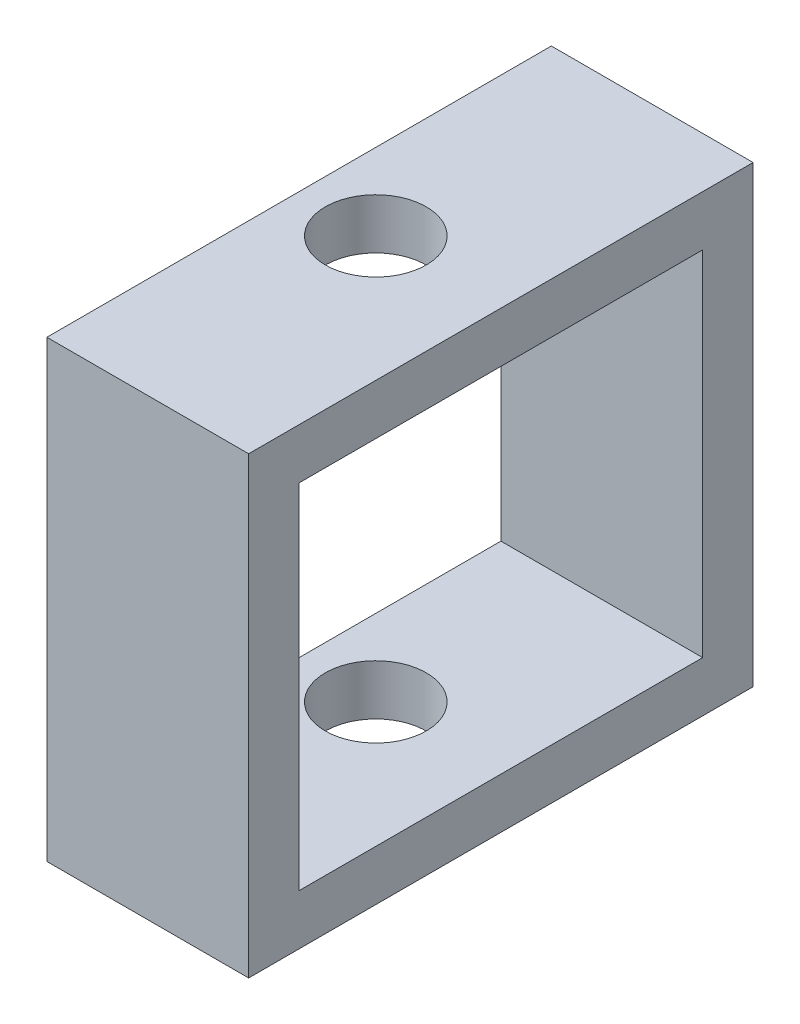
ISO-10303-21;
HEADER;
FILE_DESCRIPTION(('STEP AP214'),'2;1');
FILE_NAME('part.step','',(''),(''),'','','');
FILE_SCHEMA(('AUTOMOTIVE_DESIGN { 1 0 10303 214 1 1 1 1 }'));
ENDSEC;
DATA;
#1=APPLICATION_CONTEXT('core data for automotive mechanical design processes');
#2=APPLICATION_PROTOCOL_DEFINITION('international standard','automotive_design',2000,#1);
#3=PRODUCT_CONTEXT('',#1,'mechanical');
#4=PRODUCT('Part','Part','',(#3));
#5=PRODUCT_RELATED_PRODUCT_CATEGORY('part','',(#4));
#6=PRODUCT_DEFINITION_FORMATION('','',#4);
#7=PRODUCT_DEFINITION_CONTEXT('part definition',#1,'design');
#8=PRODUCT_DEFINITION('design','',#6,#7);
#9=PRODUCT_DEFINITION_SHAPE('','',#8);
#10=(LENGTH_UNIT() NAMED_UNIT(*) SI_UNIT(.MILLI.,.METRE.));
#11=(NAMED_UNIT(*) PLANE_ANGLE_UNIT() SI_UNIT($,.RADIAN.));
#12=(NAMED_UNIT(*) SI_UNIT($,.STERADIAN.) SOLID_ANGLE_UNIT());
#13=UNCERTAINTY_MEASURE_WITH_UNIT(LENGTH_MEASURE(1.E-05),#10,'distance_accuracy_value','');
#14=(GEOMETRIC_REPRESENTATION_CONTEXT(3) GLOBAL_UNCERTAINTY_ASSIGNED_CONTEXT((#13)) GLOBAL_UNIT_ASSIGNED_CONTEXT((#10,
#11,#12)) REPRESENTATION_CONTEXT('',''));
#15=CARTESIAN_POINT('',(0.,0.,0.));
#16=DIRECTION('',(0.,0.,1.));
#17=DIRECTION('',(1.,0.,0.));
#18=AXIS2_PLACEMENT_3D('',#15,#16,#17);
#19=CARTESIAN_POINT('',(0.,3.175,0.));
#20=DIRECTION('',(0.,-1.,0.));
#21=DIRECTION('',(0.,0.,-1.));
#22=AXIS2_PLACEMENT_3D('',#19,#20,#21);
#23=PLANE('',#22);
#24=CARTESIAN_POINT('',(4.826,3.175,-15.875));
#25=DIRECTION('',(0.,1.,0.));
#26=DIRECTION('',(0.,0.,1.));
#27=AXIS2_PLACEMENT_3D('',#24,#25,#26);
#28=CIRCLE('',#27,3.175);
#29=CARTESIAN_POINT('',(4.826,3.175,-12.7));
#30=VERTEX_POINT('',#29);
#31=EDGE_CURVE('E159',#30,#30,#28,.T.);
#32=ORIENTED_EDGE('',*,*,#31,.F.);
#33=EDGE_LOOP('',(#32));
#34=FACE_BOUND('',#33,.T.);
#35=DIRECTION('',(0.,0.,1.));
#36=VECTOR('',#35,1.);
#37=CARTESIAN_POINT('',(0.,3.175,0.));
#38=LINE('',#37,#36);
#39=CARTESIAN_POINT('',(0.,3.175,-28.575));
#40=VERTEX_POINT('',#39);
#41=CARTESIAN_POINT('',(0.,3.175,-3.175));
#42=VERTEX_POINT('',#41);
#43=EDGE_CURVE('E51',#40,#42,#38,.T.);
#44=ORIENTED_EDGE('',*,*,#43,.T.);
#45=DIRECTION('',(1.,0.,0.));
#46=VECTOR('',#45,1.);
#47=CARTESIAN_POINT('',(0.,3.175,-3.175));
#48=LINE('',#47,#46);
#49=CARTESIAN_POINT('',(12.7,3.175,-3.175));
#50=VERTEX_POINT('',#49);
#51=EDGE_CURVE('E133',#42,#50,#48,.T.);
#52=ORIENTED_EDGE('',*,*,#51,.T.);
#53=DIRECTION('',(0.,0.,-1.));
#54=VECTOR('',#53,1.);
#55=CARTESIAN_POINT('',(12.7,3.175,0.));
#56=LINE('',#55,#54);
#57=CARTESIAN_POINT('',(12.7,3.175,-28.575));
#58=VERTEX_POINT('',#57);
#59=EDGE_CURVE('E166',#50,#58,#56,.T.);
#60=ORIENTED_EDGE('',*,*,#59,.T.);
#61=DIRECTION('',(1.,0.,0.));
#62=VECTOR('',#61,1.);
#63=CARTESIAN_POINT('',(0.,3.175,-28.575));
#64=LINE('',#63,#62);
#65=EDGE_CURVE('E56',#40,#58,#64,.T.);
#66=ORIENTED_EDGE('',*,*,#65,.F.);
#67=EDGE_LOOP('',(#44,#52,#60,#66));
#68=FACE_BOUND('',#67,.T.);
#69=ADVANCED_FACE('F36',(#34,#68),#23,.F.);
#70=CARTESIAN_POINT('',(0.,0.,0.));
#71=DIRECTION('',(0.,-1.,0.));
#72=DIRECTION('',(0.,0.,-1.));
#73=AXIS2_PLACEMENT_3D('',#70,#71,#72);
#74=PLANE('',#73);
#75=DIRECTION('',(0.,0.,1.));
#76=VECTOR('',#75,1.);
#77=CARTESIAN_POINT('',(0.,0.,0.));
#78=LINE('',#77,#76);
#79=CARTESIAN_POINT('',(0.,0.,-31.75));
#80=VERTEX_POINT('',#79);
#81=CARTESIAN_POINT('',(0.,0.,0.));
#82=VERTEX_POINT('',#81);
#83=EDGE_CURVE('E162',#80,#82,#78,.T.);
#84=ORIENTED_EDGE('',*,*,#83,.F.);
#85=DIRECTION('',(-1.,0.,0.));
#86=VECTOR('',#85,1.);
#87=CARTESIAN_POINT('',(0.,0.,-31.75));
#88=LINE('',#87,#86);
#89=CARTESIAN_POINT('',(12.7,0.,-31.75));
#90=VERTEX_POINT('',#89);
#91=EDGE_CURVE('E167',#90,#80,#88,.T.);
#92=ORIENTED_EDGE('',*,*,#91,.F.);
#93=DIRECTION('',(0.,0.,-1.));
#94=VECTOR('',#93,1.);
#95=CARTESIAN_POINT('',(12.7,0.,0.));
#96=LINE('',#95,#94);
#97=CARTESIAN_POINT('',(12.7,0.,0.));
#98=VERTEX_POINT('',#97);
#99=EDGE_CURVE('E108',#98,#90,#96,.T.);
#100=ORIENTED_EDGE('',*,*,#99,.F.);
#101=DIRECTION('',(1.,0.,0.));
#102=VECTOR('',#101,1.);
#103=CARTESIAN_POINT('',(0.,0.,0.));
#104=LINE('',#103,#102);
#105=EDGE_CURVE('E171',#82,#98,#104,.T.);
#106=ORIENTED_EDGE('',*,*,#105,.F.);
#107=EDGE_LOOP('',(#84,#92,#100,#106));
#108=FACE_BOUND('',#107,.T.);
#109=CARTESIAN_POINT('',(4.826,0.,-15.875));
#110=DIRECTION('',(0.,1.,0.));
#111=DIRECTION('',(0.,0.,1.));
#112=AXIS2_PLACEMENT_3D('',#109,#110,#111);
#113=CIRCLE('',#112,3.175);
#114=CARTESIAN_POINT('',(4.826,0.,-12.7));
#115=VERTEX_POINT('',#114);
#116=EDGE_CURVE('E158',#115,#115,#113,.T.);
#117=ORIENTED_EDGE('',*,*,#116,.T.);
#118=EDGE_LOOP('',(#117));
#119=FACE_BOUND('',#118,.T.);
#120=ADVANCED_FACE('F178',(#108,#119),#74,.T.);
#121=CARTESIAN_POINT('',(0.,3.175,0.));
#122=DIRECTION('',(1.,0.,0.));
#123=DIRECTION('',(0.,0.,-1.));
#124=AXIS2_PLACEMENT_3D('',#121,#122,#123);
#125=PLANE('',#124);
#126=DIRECTION('',(0.,-1.,0.));
#127=VECTOR('',#126,1.);
#128=CARTESIAN_POINT('',(0.,25.4,-28.575));
#129=LINE('',#128,#127);
#130=CARTESIAN_POINT('',(0.,25.4,-28.575));
#131=VERTEX_POINT('',#130);
#132=EDGE_CURVE('E155',#131,#40,#129,.T.);
#133=ORIENTED_EDGE('',*,*,#132,.F.);
#134=DIRECTION('',(0.,0.,1.));
#135=VECTOR('',#134,1.);
#136=CARTESIAN_POINT('',(0.,25.4,-3.175));
#137=LINE('',#136,#135);
#138=CARTESIAN_POINT('',(0.,25.4,-3.175));
#139=VERTEX_POINT('',#138);
#140=EDGE_CURVE('E134',#131,#139,#137,.T.);
#141=ORIENTED_EDGE('',*,*,#140,.T.);
#142=DIRECTION('',(0.,-1.,0.));
#143=VECTOR('',#142,1.);
#144=CARTESIAN_POINT('',(0.,25.4,-3.175));
#145=LINE('',#144,#143);
#146=EDGE_CURVE('E146',#139,#42,#145,.T.);
#147=ORIENTED_EDGE('',*,*,#146,.T.);
#148=ORIENTED_EDGE('',*,*,#43,.F.);
#149=EDGE_LOOP('',(#133,#141,#147,#148));
#150=FACE_BOUND('',#149,.T.);
#151=ORIENTED_EDGE('',*,*,#83,.T.);
#152=DIRECTION('',(0.,-1.,0.));
#153=VECTOR('',#152,1.);
#154=CARTESIAN_POINT('',(0.,3.175,0.));
#155=LINE('',#154,#153);
#156=CARTESIAN_POINT('',(0.,28.575,0.));
#157=VERTEX_POINT('',#156);
#158=EDGE_CURVE('E11',#157,#82,#155,.T.);
#159=ORIENTED_EDGE('',*,*,#158,.F.);
#160=DIRECTION('',(0.,0.,1.));
#161=VECTOR('',#160,1.);
#162=CARTESIAN_POINT('',(0.,28.575,-31.75));
#163=LINE('',#162,#161);
#164=CARTESIAN_POINT('',(0.,28.575,-31.75));
#165=VERTEX_POINT('',#164);
#166=EDGE_CURVE('E127',#165,#157,#163,.T.);
#167=ORIENTED_EDGE('',*,*,#166,.F.);
#168=DIRECTION('',(0.,-1.,0.));
#169=VECTOR('',#168,1.);
#170=CARTESIAN_POINT('',(0.,3.175,-31.75));
#171=LINE('',#170,#169);
#172=EDGE_CURVE('E112',#165,#80,#171,.T.);
#173=ORIENTED_EDGE('',*,*,#172,.T.);
#174=EDGE_LOOP('',(#151,#159,#167,#173));
#175=FACE_BOUND('',#174,.T.);
#176=ADVANCED_FACE('F38',(#150,#175),#125,.F.);
#177=CARTESIAN_POINT('',(0.,3.175,0.));
#178=DIRECTION('',(0.,0.,-1.));
#179=DIRECTION('',(-1.,0.,0.));
#180=AXIS2_PLACEMENT_3D('',#177,#178,#179);
#181=PLANE('',#180);
#182=ORIENTED_EDGE('',*,*,#105,.T.);
#183=DIRECTION('',(0.,-1.,0.));
#184=VECTOR('',#183,1.);
#185=CARTESIAN_POINT('',(12.7,3.175,0.));
#186=LINE('',#185,#184);
#187=CARTESIAN_POINT('',(12.7,28.575,0.));
#188=VERTEX_POINT('',#187);
#189=EDGE_CURVE('E44',#188,#98,#186,.T.);
#190=ORIENTED_EDGE('',*,*,#189,.F.);
#191=DIRECTION('',(1.,0.,0.));
#192=VECTOR('',#191,1.);
#193=CARTESIAN_POINT('',(0.,28.575,0.));
#194=LINE('',#193,#192);
#195=EDGE_CURVE('E122',#157,#188,#194,.T.);
#196=ORIENTED_EDGE('',*,*,#195,.F.);
#197=ORIENTED_EDGE('',*,*,#158,.T.);
#198=EDGE_LOOP('',(#182,#190,#196,#197));
#199=FACE_BOUND('',#198,.T.);
#200=ADVANCED_FACE('F181',(#199),#181,.F.);
#201=CARTESIAN_POINT('',(12.7,3.175,0.));
#202=DIRECTION('',(-1.,0.,0.));
#203=DIRECTION('',(0.,0.,1.));
#204=AXIS2_PLACEMENT_3D('',#201,#202,#203);
#205=PLANE('',#204);
#206=DIRECTION('',(0.,-1.,0.));
#207=VECTOR('',#206,1.);
#208=CARTESIAN_POINT('',(12.7,3.175,-31.75));
#209=LINE('',#208,#207);
#210=CARTESIAN_POINT('',(12.7,28.575,-31.75));
#211=VERTEX_POINT('',#210);
#212=EDGE_CURVE('E100',#211,#90,#209,.T.);
#213=ORIENTED_EDGE('',*,*,#212,.F.);
#214=DIRECTION('',(0.,0.,-1.));
#215=VECTOR('',#214,1.);
#216=CARTESIAN_POINT('',(12.7,28.575,-3.175));
#217=LINE('',#216,#215);
#218=EDGE_CURVE('E105',#188,#211,#217,.T.);
#219=ORIENTED_EDGE('',*,*,#218,.F.);
#220=ORIENTED_EDGE('',*,*,#189,.T.);
#221=ORIENTED_EDGE('',*,*,#99,.T.);
#222=EDGE_LOOP('',(#213,#219,#220,#221));
#223=FACE_BOUND('',#222,.T.);
#224=DIRECTION('',(0.,0.,-1.));
#225=VECTOR('',#224,1.);
#226=CARTESIAN_POINT('',(12.7,25.4,0.));
#227=LINE('',#226,#225);
#228=CARTESIAN_POINT('',(12.7,25.4,-3.175));
#229=VERTEX_POINT('',#228);
#230=CARTESIAN_POINT('',(12.7,25.4,-28.575));
#231=VERTEX_POINT('',#230);
#232=EDGE_CURVE('E123',#229,#231,#227,.T.);
#233=ORIENTED_EDGE('',*,*,#232,.T.);
#234=DIRECTION('',(0.,-1.,0.));
#235=VECTOR('',#234,1.);
#236=CARTESIAN_POINT('',(12.7,25.4,-28.575));
#237=LINE('',#236,#235);
#238=EDGE_CURVE('E151',#231,#58,#237,.T.);
#239=ORIENTED_EDGE('',*,*,#238,.T.);
#240=ORIENTED_EDGE('',*,*,#59,.F.);
#241=DIRECTION('',(0.,-1.,0.));
#242=VECTOR('',#241,1.);
#243=CARTESIAN_POINT('',(12.7,25.4,-3.175));
#244=LINE('',#243,#242);
#245=EDGE_CURVE('E142',#229,#50,#244,.T.);
#246=ORIENTED_EDGE('',*,*,#245,.F.);
#247=EDGE_LOOP('',(#233,#239,#240,#246));
#248=FACE_BOUND('',#247,.T.);
#249=ADVANCED_FACE('F102',(#223,#248),#205,.F.);
#250=CARTESIAN_POINT('',(0.,3.175,-31.75));
#251=DIRECTION('',(0.,0.,1.));
#252=DIRECTION('',(1.,0.,0.));
#253=AXIS2_PLACEMENT_3D('',#250,#251,#252);
#254=PLANE('',#253);
#255=ORIENTED_EDGE('',*,*,#91,.T.);
#256=ORIENTED_EDGE('',*,*,#172,.F.);
#257=DIRECTION('',(-1.,0.,0.));
#258=VECTOR('',#257,1.);
#259=CARTESIAN_POINT('',(12.7,28.575,-31.75));
#260=LINE('',#259,#258);
#261=EDGE_CURVE('E119',#211,#165,#260,.T.);
#262=ORIENTED_EDGE('',*,*,#261,.F.);
#263=ORIENTED_EDGE('',*,*,#212,.T.);
#264=EDGE_LOOP('',(#255,#256,#262,#263));
#265=FACE_BOUND('',#264,.T.);
#266=ADVANCED_FACE('F125',(#265),#254,.F.);
#267=CARTESIAN_POINT('',(4.826,3.175,-15.875));
#268=DIRECTION('',(0.,-1.,0.));
#269=DIRECTION('',(0.,0.,-1.));
#270=AXIS2_PLACEMENT_3D('',#267,#268,#269);
#271=CYLINDRICAL_SURFACE('',#270,3.175);
#272=ORIENTED_EDGE('',*,*,#31,.T.);
#273=EDGE_LOOP('',(#272));
#274=FACE_BOUND('',#273,.T.);
#275=ORIENTED_EDGE('',*,*,#116,.F.);
#276=EDGE_LOOP('',(#275));
#277=FACE_BOUND('',#276,.T.);
#278=ADVANCED_FACE('F198',(#274,#277),#271,.F.);
#279=CARTESIAN_POINT('',(0.,25.4,-28.575));
#280=DIRECTION('',(0.,0.,-1.));
#281=DIRECTION('',(-1.,0.,0.));
#282=AXIS2_PLACEMENT_3D('',#279,#280,#281);
#283=PLANE('',#282);
#284=ORIENTED_EDGE('',*,*,#65,.T.);
#285=ORIENTED_EDGE('',*,*,#238,.F.);
#286=DIRECTION('',(1.,0.,0.));
#287=VECTOR('',#286,1.);
#288=CARTESIAN_POINT('',(0.,25.4,-28.575));
#289=LINE('',#288,#287);
#290=EDGE_CURVE('E148',#131,#231,#289,.T.);
#291=ORIENTED_EDGE('',*,*,#290,.F.);
#292=ORIENTED_EDGE('',*,*,#132,.T.);
#293=EDGE_LOOP('',(#284,#285,#291,#292));
#294=FACE_BOUND('',#293,.T.);
#295=ADVANCED_FACE('F205',(#294),#283,.F.);
#296=CARTESIAN_POINT('',(0.,25.4,-3.175));
#297=DIRECTION('',(0.,0.,-1.));
#298=DIRECTION('',(-1.,0.,0.));
#299=AXIS2_PLACEMENT_3D('',#296,#297,#298);
#300=PLANE('',#299);
#301=ORIENTED_EDGE('',*,*,#51,.F.);
#302=ORIENTED_EDGE('',*,*,#146,.F.);
#303=DIRECTION('',(1.,0.,0.));
#304=VECTOR('',#303,1.);
#305=CARTESIAN_POINT('',(0.,25.4,-3.175));
#306=LINE('',#305,#304);
#307=EDGE_CURVE('E140',#139,#229,#306,.T.);
#308=ORIENTED_EDGE('',*,*,#307,.T.);
#309=ORIENTED_EDGE('',*,*,#245,.T.);
#310=EDGE_LOOP('',(#301,#302,#308,#309));
#311=FACE_BOUND('',#310,.T.);
#312=ADVANCED_FACE('F210',(#311),#300,.T.);
#313=CARTESIAN_POINT('',(0.,25.4,0.));
#314=DIRECTION('',(0.,1.,0.));
#315=DIRECTION('',(0.,0.,1.));
#316=AXIS2_PLACEMENT_3D('',#313,#314,#315);
#317=PLANE('',#316);
#318=CARTESIAN_POINT('',(4.826,25.4,-15.875));
#319=DIRECTION('',(0.,1.,0.));
#320=DIRECTION('',(0.,0.,1.));
#321=AXIS2_PLACEMENT_3D('',#318,#319,#320);
#322=CIRCLE('',#321,3.175);
#323=CARTESIAN_POINT('',(4.826,25.4,-12.7));
#324=VERTEX_POINT('',#323);
#325=EDGE_CURVE('E236',#324,#324,#322,.T.);
#326=ORIENTED_EDGE('',*,*,#325,.T.);
#327=EDGE_LOOP('',(#326));
#328=FACE_BOUND('',#327,.T.);
#329=ORIENTED_EDGE('',*,*,#140,.F.);
#330=ORIENTED_EDGE('',*,*,#290,.T.);
#331=ORIENTED_EDGE('',*,*,#232,.F.);
#332=ORIENTED_EDGE('',*,*,#307,.F.);
#333=EDGE_LOOP('',(#329,#330,#331,#332));
#334=FACE_BOUND('',#333,.T.);
#335=ADVANCED_FACE('F217',(#328,#334),#317,.F.);
#336=CARTESIAN_POINT('',(0.,28.575,0.));
#337=DIRECTION('',(0.,1.,0.));
#338=DIRECTION('',(0.,0.,1.));
#339=AXIS2_PLACEMENT_3D('',#336,#337,#338);
#340=PLANE('',#339);
#341=ORIENTED_EDGE('',*,*,#218,.T.);
#342=ORIENTED_EDGE('',*,*,#261,.T.);
#343=ORIENTED_EDGE('',*,*,#166,.T.);
#344=ORIENTED_EDGE('',*,*,#195,.T.);
#345=EDGE_LOOP('',(#341,#342,#343,#344));
#346=FACE_BOUND('',#345,.T.);
#347=CARTESIAN_POINT('',(4.826,28.575,-15.875));
#348=DIRECTION('',(0.,1.,0.));
#349=DIRECTION('',(0.,0.,1.));
#350=AXIS2_PLACEMENT_3D('',#347,#348,#349);
#351=CIRCLE('',#350,3.175);
#352=CARTESIAN_POINT('',(4.826,28.575,-12.7));
#353=VERTEX_POINT('',#352);
#354=EDGE_CURVE('E137',#353,#353,#351,.T.);
#355=ORIENTED_EDGE('',*,*,#354,.F.);
#356=EDGE_LOOP('',(#355));
#357=FACE_BOUND('',#356,.T.);
#358=ADVANCED_FACE('F116',(#346,#357),#340,.T.);
#359=CARTESIAN_POINT('',(4.826,28.575,-15.875));
#360=DIRECTION('',(0.,-1.,0.));
#361=DIRECTION('',(0.,0.,-1.));
#362=AXIS2_PLACEMENT_3D('',#359,#360,#361);
#363=CYLINDRICAL_SURFACE('',#362,3.175);
#364=ORIENTED_EDGE('',*,*,#354,.T.);
#365=EDGE_LOOP('',(#364));
#366=FACE_BOUND('',#365,.T.);
#367=ORIENTED_EDGE('',*,*,#325,.F.);
#368=EDGE_LOOP('',(#367));
#369=FACE_BOUND('',#368,.T.);
#370=ADVANCED_FACE('F226',(#366,#369),#363,.F.);
#371=CLOSED_SHELL('',(#69,#120,#176,#200,#249,#266,#278,#295,#312,#335,#358,#370));
#372=MANIFOLD_SOLID_BREP('B2',#371);
#373=ADVANCED_BREP_SHAPE_REPRESENTATION('',(#18,#372),#14);
#374=SHAPE_DEFINITION_REPRESENTATION(#9,#373);
ENDSEC;
END-ISO-10303-21;
